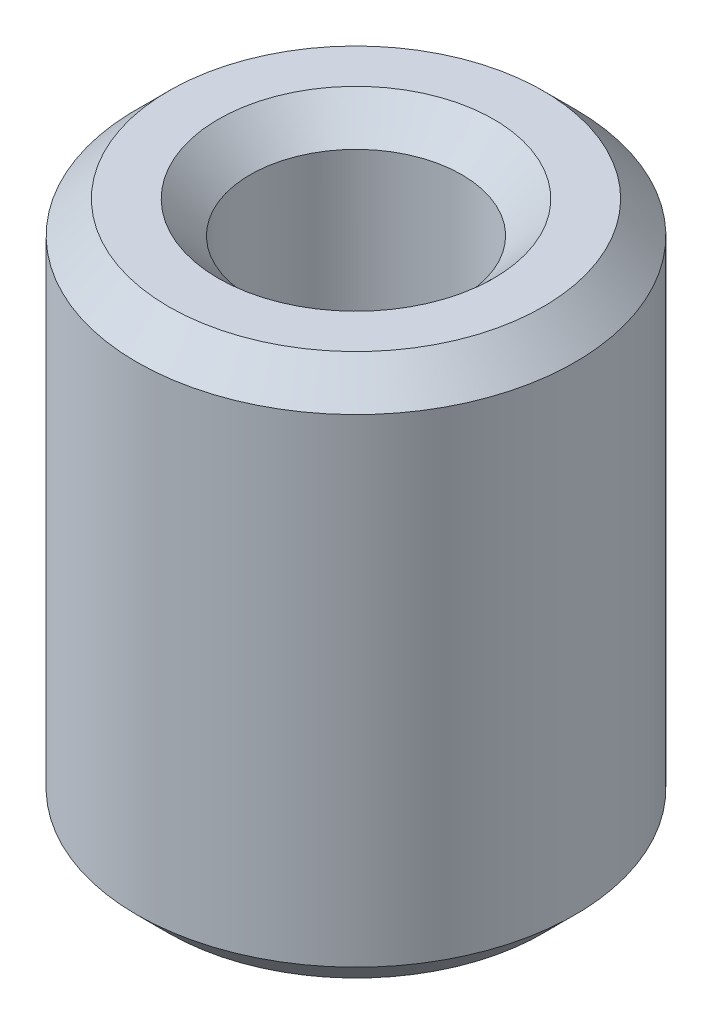
ISO-10303-21;
HEADER;
FILE_DESCRIPTION(('STEP AP214'),'2;1');
FILE_NAME('part.step','',(''),(''),'','','');
FILE_SCHEMA(('AUTOMOTIVE_DESIGN { 1 0 10303 214 1 1 1 1 }'));
ENDSEC;
DATA;
#1=APPLICATION_CONTEXT('core data for automotive mechanical design processes');
#2=APPLICATION_PROTOCOL_DEFINITION('international standard','automotive_design',2000,#1);
#3=PRODUCT_CONTEXT('',#1,'mechanical');
#4=PRODUCT('Part','Part','',(#3));
#5=PRODUCT_RELATED_PRODUCT_CATEGORY('part','',(#4));
#6=PRODUCT_DEFINITION_FORMATION('','',#4);
#7=PRODUCT_DEFINITION_CONTEXT('part definition',#1,'design');
#8=PRODUCT_DEFINITION('design','',#6,#7);
#9=PRODUCT_DEFINITION_SHAPE('','',#8);
#10=(LENGTH_UNIT() NAMED_UNIT(*) SI_UNIT(.MILLI.,.METRE.));
#11=(NAMED_UNIT(*) PLANE_ANGLE_UNIT() SI_UNIT($,.RADIAN.));
#12=(NAMED_UNIT(*) SI_UNIT($,.STERADIAN.) SOLID_ANGLE_UNIT());
#13=UNCERTAINTY_MEASURE_WITH_UNIT(LENGTH_MEASURE(1.E-05),#10,'distance_accuracy_value','');
#14=(GEOMETRIC_REPRESENTATION_CONTEXT(3) GLOBAL_UNCERTAINTY_ASSIGNED_CONTEXT((#13)) GLOBAL_UNIT_ASSIGNED_CONTEXT((#10,
#11,#12)) REPRESENTATION_CONTEXT('',''));
#15=CARTESIAN_POINT('',(0.,0.,0.));
#16=DIRECTION('',(0.,0.,1.));
#17=DIRECTION('',(1.,0.,0.));
#18=AXIS2_PLACEMENT_3D('',#15,#16,#17);
#19=CARTESIAN_POINT('',(0.,12.3808773999114,0.));
#20=DIRECTION('',(0.,-1.,0.));
#21=DIRECTION('',(0.,0.,-1.));
#22=AXIS2_PLACEMENT_3D('',#19,#20,#21);
#23=CYLINDRICAL_SURFACE('',#22,5.);
#24=CARTESIAN_POINT('',(0.,0.729539155545508,0.));
#25=DIRECTION('',(0.,1.,0.));
#26=DIRECTION('',(0.,0.,1.));
#27=AXIS2_PLACEMENT_3D('',#24,#25,#26);
#28=CIRCLE('',#27,5.);
#29=CARTESIAN_POINT('',(0.,0.729539155545508,5.));
#30=VERTEX_POINT('',#29);
#31=EDGE_CURVE('E10',#30,#30,#28,.T.);
#32=ORIENTED_EDGE('',*,*,#31,.T.);
#33=EDGE_LOOP('',(#32));
#34=FACE_BOUND('',#33,.T.);
#35=CARTESIAN_POINT('',(0.,11.6513382443659,0.));
#36=DIRECTION('',(0.,1.,0.));
#37=DIRECTION('',(0.,0.,1.));
#38=AXIS2_PLACEMENT_3D('',#35,#36,#37);
#39=CIRCLE('',#38,5.);
#40=CARTESIAN_POINT('',(0.,11.6513382443659,5.));
#41=VERTEX_POINT('',#40);
#42=EDGE_CURVE('E50',#41,#41,#39,.F.);
#43=ORIENTED_EDGE('',*,*,#42,.T.);
#44=EDGE_LOOP('',(#43));
#45=FACE_BOUND('',#44,.T.);
#46=ADVANCED_FACE('F39',(#34,#45),#23,.T.);
#47=CARTESIAN_POINT('',(0.,12.3808773999114,0.));
#48=DIRECTION('',(0.,1.,0.));
#49=DIRECTION('',(0.,0.,1.));
#50=AXIS2_PLACEMENT_3D('',#47,#48,#49);
#51=PLANE('',#50);
#52=CARTESIAN_POINT('',(0.,12.3808773999114,0.));
#53=DIRECTION('',(0.,1.,0.));
#54=DIRECTION('',(0.,0.,1.));
#55=AXIS2_PLACEMENT_3D('',#52,#53,#54);
#56=CIRCLE('',#55,3.14358391073258);
#57=CARTESIAN_POINT('',(0.,12.3808773999114,3.14358391073258));
#58=VERTEX_POINT('',#57);
#59=EDGE_CURVE('E58',#58,#58,#56,.F.);
#60=ORIENTED_EDGE('',*,*,#59,.T.);
#61=EDGE_LOOP('',(#60));
#62=FACE_BOUND('',#61,.T.);
#63=CARTESIAN_POINT('',(0.,12.3808773999114,0.));
#64=DIRECTION('',(0.,1.,0.));
#65=DIRECTION('',(0.,0.,1.));
#66=AXIS2_PLACEMENT_3D('',#63,#64,#65);
#67=CIRCLE('',#66,4.27046084445449);
#68=CARTESIAN_POINT('',(0.,12.3808773999114,4.27046084445449));
#69=VERTEX_POINT('',#68);
#70=EDGE_CURVE('E61',#69,#69,#67,.T.);
#71=ORIENTED_EDGE('',*,*,#70,.T.);
#72=EDGE_LOOP('',(#71));
#73=FACE_BOUND('',#72,.T.);
#74=ADVANCED_FACE('F88',(#62,#73),#51,.T.);
#75=CARTESIAN_POINT('',(0.,0.,0.));
#76=DIRECTION('',(0.,1.,0.));
#77=DIRECTION('',(0.,0.,1.));
#78=AXIS2_PLACEMENT_3D('',#75,#76,#77);
#79=PLANE('',#78);
#80=CARTESIAN_POINT('',(0.,0.,0.));
#81=DIRECTION('',(0.,1.,0.));
#82=DIRECTION('',(0.,0.,1.));
#83=AXIS2_PLACEMENT_3D('',#80,#81,#82);
#84=CIRCLE('',#83,3.14358391073258);
#85=CARTESIAN_POINT('',(0.,0.,-3.14358391073258));
#86=VERTEX_POINT('',#85);
#87=EDGE_CURVE('E51',#86,#86,#84,.T.);
#88=ORIENTED_EDGE('',*,*,#87,.T.);
#89=EDGE_LOOP('',(#88));
#90=FACE_BOUND('',#89,.T.);
#91=CARTESIAN_POINT('',(0.,0.,0.));
#92=DIRECTION('',(0.,1.,0.));
#93=DIRECTION('',(0.,0.,1.));
#94=AXIS2_PLACEMENT_3D('',#91,#92,#93);
#95=CIRCLE('',#94,4.27046084445449);
#96=CARTESIAN_POINT('',(0.,0.,4.27046084445449));
#97=VERTEX_POINT('',#96);
#98=EDGE_CURVE('E54',#97,#97,#95,.F.);
#99=ORIENTED_EDGE('',*,*,#98,.T.);
#100=EDGE_LOOP('',(#99));
#101=FACE_BOUND('',#100,.T.);
#102=ADVANCED_FACE('F83',(#90,#101),#79,.F.);
#103=CARTESIAN_POINT('',(0.,12.3808773999114,0.));
#104=DIRECTION('',(0.,-1.,0.));
#105=DIRECTION('',(0.,0.,-1.));
#106=AXIS2_PLACEMENT_3D('',#103,#104,#105);
#107=CYLINDRICAL_SURFACE('',#106,2.41404475518707);
#108=CARTESIAN_POINT('',(0.,11.6513382443659,0.));
#109=DIRECTION('',(0.,1.,0.));
#110=DIRECTION('',(0.,0.,1.));
#111=AXIS2_PLACEMENT_3D('',#108,#109,#110);
#112=CIRCLE('',#111,2.41404475518707);
#113=CARTESIAN_POINT('',(0.,11.6513382443659,2.41404475518707));
#114=VERTEX_POINT('',#113);
#115=EDGE_CURVE('E67',#114,#114,#112,.T.);
#116=ORIENTED_EDGE('',*,*,#115,.T.);
#117=EDGE_LOOP('',(#116));
#118=FACE_BOUND('',#117,.T.);
#119=CARTESIAN_POINT('',(0.,0.729539155545515,0.));
#120=DIRECTION('',(0.,1.,0.));
#121=DIRECTION('',(0.,0.,1.));
#122=AXIS2_PLACEMENT_3D('',#119,#120,#121);
#123=CIRCLE('',#122,2.41404475518707);
#124=CARTESIAN_POINT('',(0.,0.729539155545515,-2.41404475518707));
#125=VERTEX_POINT('',#124);
#126=EDGE_CURVE('E69',#125,#125,#123,.F.);
#127=ORIENTED_EDGE('',*,*,#126,.T.);
#128=EDGE_LOOP('',(#127));
#129=FACE_BOUND('',#128,.T.);
#130=ADVANCED_FACE('F71',(#118,#129),#107,.F.);
#131=CARTESIAN_POINT('',(0.,11.6513382443659,0.));
#132=DIRECTION('',(0.,1.,0.));
#133=DIRECTION('',(0.,0.,1.));
#134=AXIS2_PLACEMENT_3D('',#131,#132,#133);
#135=CONICAL_SURFACE('',#134,2.41404475518707,0.785398163397451);
#136=ORIENTED_EDGE('',*,*,#59,.F.);
#137=EDGE_LOOP('',(#136));
#138=FACE_BOUND('',#137,.T.);
#139=ORIENTED_EDGE('',*,*,#115,.F.);
#140=EDGE_LOOP('',(#139));
#141=FACE_BOUND('',#140,.T.);
#142=ADVANCED_FACE('F77',(#138,#141),#135,.F.);
#143=CARTESIAN_POINT('',(0.,0.,0.));
#144=DIRECTION('',(0.,-1.,0.));
#145=DIRECTION('',(0.,0.,-1.));
#146=AXIS2_PLACEMENT_3D('',#143,#144,#145);
#147=CONICAL_SURFACE('',#146,3.14358391073258,0.785398163397444);
#148=CARTESIAN_POINT('',(0.,0.729539155545515,-2.41404475518707));
#149=CARTESIAN_POINT('',(0.,0.721939789341916,-2.42164412139067));
#150=CARTESIAN_POINT('',(0.,0.714340423138317,-2.42924348759427));
#151=CARTESIAN_POINT('',(0.,0.699141690731119,-2.44444222000147));
#152=CARTESIAN_POINT('',(0.,0.69154232452752,-2.45204158620506));
#153=CARTESIAN_POINT('',(0.,0.676343592120321,-2.46724031861226));
#154=CARTESIAN_POINT('',(0.,0.668744225916722,-2.47483968481586));
#155=CARTESIAN_POINT('',(0.,0.653545493509524,-2.49003841722306));
#156=CARTESIAN_POINT('',(0.,0.645946127305925,-2.49763778342666));
#157=CARTESIAN_POINT('',(0.,0.630747394898727,-2.51283651583386));
#158=CARTESIAN_POINT('',(0.,0.623148028695127,-2.52043588203746));
#159=CARTESIAN_POINT('',(0.,0.607949296287929,-2.53563461444465));
#160=CARTESIAN_POINT('',(0.,0.60034993008433,-2.54323398064825));
#161=CARTESIAN_POINT('',(0.,0.585151197677132,-2.55843271305545));
#162=CARTESIAN_POINT('',(0.,0.577551831473533,-2.56603207925905));
#163=CARTESIAN_POINT('',(0.,0.562353099066335,-2.58123081166625));
#164=CARTESIAN_POINT('',(0.,0.554753732862735,-2.58883017786985));
#165=CARTESIAN_POINT('',(0.,0.539555000455537,-2.60402891027705));
#166=CARTESIAN_POINT('',(0.,0.531955634251938,-2.61162827648064));
#167=CARTESIAN_POINT('',(0.,0.51675690184474,-2.62682700888784));
#168=CARTESIAN_POINT('',(0.,0.509157535641141,-2.63442637509144));
#169=CARTESIAN_POINT('',(0.,0.493958803233943,-2.64962510749864));
#170=CARTESIAN_POINT('',(0.,0.486359437030343,-2.65722447370224));
#171=CARTESIAN_POINT('',(0.,0.471160704623145,-2.67242320610944));
#172=CARTESIAN_POINT('',(0.,0.463561338419546,-2.68002257231304));
#173=CARTESIAN_POINT('',(0.,0.448362606012348,-2.69522130472023));
#174=CARTESIAN_POINT('',(0.,0.440763239808749,-2.70282067092383));
#175=CARTESIAN_POINT('',(0.,0.42556450740155,-2.71801940333103));
#176=CARTESIAN_POINT('',(0.,0.417965141197951,-2.72561876953463));
#177=CARTESIAN_POINT('',(0.,0.402766408790753,-2.74081750194183));
#178=CARTESIAN_POINT('',(0.,0.395167042587154,-2.74841686814543));
#179=CARTESIAN_POINT('',(0.,0.379968310179956,-2.76361560055263));
#180=CARTESIAN_POINT('',(0.,0.372368943976357,-2.77121496675622));
#181=CARTESIAN_POINT('',(0.,0.357170211569158,-2.78641369916342));
#182=CARTESIAN_POINT('',(0.,0.349570845365559,-2.79401306536702));
#183=CARTESIAN_POINT('',(0.,0.334372112958361,-2.80921179777422));
#184=CARTESIAN_POINT('',(0.,0.326772746754762,-2.81681116397782));
#185=CARTESIAN_POINT('',(0.,0.311574014347564,-2.83200989638502));
#186=CARTESIAN_POINT('',(0.,0.303974648143965,-2.83960926258862));
#187=CARTESIAN_POINT('',(0.,0.288775915736766,-2.85480799499581));
#188=CARTESIAN_POINT('',(0.,0.281176549533167,-2.86240736119941));
#189=CARTESIAN_POINT('',(0.,0.265977817125969,-2.87760609360661));
#190=CARTESIAN_POINT('',(0.,0.25837845092237,-2.88520545981021));
#191=CARTESIAN_POINT('',(0.,0.243179718515172,-2.90040419221741));
#192=CARTESIAN_POINT('',(0.,0.235580352311573,-2.90800355842101));
#193=CARTESIAN_POINT('',(0.,0.220381619904374,-2.92320229082821));
#194=CARTESIAN_POINT('',(0.,0.212782253700775,-2.9308016570318));
#195=CARTESIAN_POINT('',(0.,0.197583521293577,-2.946000389439));
#196=CARTESIAN_POINT('',(0.,0.189984155089978,-2.9535997556426));
#197=CARTESIAN_POINT('',(0.,0.17478542268278,-2.9687984880498));
#198=CARTESIAN_POINT('',(0.,0.167186056479181,-2.9763978542534));
#199=CARTESIAN_POINT('',(0.,0.151987324071982,-2.9915965866606));
#200=CARTESIAN_POINT('',(0.,0.144387957868383,-2.9991959528642));
#201=CARTESIAN_POINT('',(0.,0.129189225461185,-3.01439468527139));
#202=CARTESIAN_POINT('',(0.,0.121589859257586,-3.02199405147499));
#203=CARTESIAN_POINT('',(0.,0.106391126850388,-3.03719278388219));
#204=CARTESIAN_POINT('',(0.,0.0987917606467885,-3.04479215008579));
#205=CARTESIAN_POINT('',(0.,0.0835930282395903,-3.05999088249299));
#206=CARTESIAN_POINT('',(0.,0.0759936620359912,-3.06759024869659));
#207=CARTESIAN_POINT('',(0.,0.0607949296287929,-3.08278898110379));
#208=CARTESIAN_POINT('',(0.,0.0531955634251938,-3.09038834730738));
#209=CARTESIAN_POINT('',(0.,0.0379968310179956,-3.10558707971458));
#210=CARTESIAN_POINT('',(0.,0.0303974648143965,-3.11318644591818));
#211=CARTESIAN_POINT('',(0.,0.0151987324071982,-3.12838517832538));
#212=CARTESIAN_POINT('',(0.,0.00759936620359911,-3.13598454452898));
#213=CARTESIAN_POINT('',(0.,0.,-3.14358391073258));
#214=B_SPLINE_CURVE_WITH_KNOTS('',3,(#148,#149,#150,#151,#152,#153,#154,#155,#156,#157,#158,
#159,#160,#161,#162,#163,#164,#165,#166,#167,#168,#169,#170,#171,#172,#173,#174,#175,#176,#177,
#178,#179,#180,#181,#182,#183,#184,#185,#186,#187,#188,#189,#190,#191,#192,#193,#194,#195,#196,
#197,#198,#199,#200,#201,#202,#203,#204,#205,#206,#207,#208,#209,#210,#211,#212,#213),
.UNSPECIFIED.,.F.,.F.,(4,2,2,2,2,2,2,2,2,2,2,2,2,2,2,2,2,2,2,2,2,2,2,2,2,2,2,2,2,2,2,2,4),(0.,
0.0322413802517087,0.0644827605034174,0.096724140755126,0.128965521006835,0.161206901258543,
0.193448281510252,0.225689661761961,0.257931042013669,0.290172422265378,0.322413802517087,
0.354655182768795,0.386896563020504,0.419137943272213,0.451379323523921,0.48362070377563,
0.515862084027339,0.548103464279047,0.580344844530756,0.612586224782465,0.644827605034174,
0.677068985285882,0.709310365537591,0.7415517457893,0.773793126041008,0.806034506292717,
0.838275886544426,0.870517266796135,0.902758647047843,0.935000027299552,0.967241407551261,
0.999482787802969,1.03172416805468),.UNSPECIFIED.);
#215=EDGE_CURVE('BSEAM73',#125,#86,#214,.T.);
#216=ORIENTED_EDGE('',*,*,#126,.F.);
#217=ORIENTED_EDGE('',*,*,#87,.F.);
#218=ORIENTED_EDGE('',*,*,#215,.T.);
#219=ORIENTED_EDGE('',*,*,#215,.F.);
#220=EDGE_LOOP('',(#216,#218,#217,#219));
#221=FACE_BOUND('',#220,.T.);
#222=ADVANCED_FACE('F73',(#221),#147,.F.);
#223=CARTESIAN_POINT('',(0.,0.729539155545508,0.));
#224=DIRECTION('',(0.,1.,0.));
#225=DIRECTION('',(0.,0.,1.));
#226=AXIS2_PLACEMENT_3D('',#223,#224,#225);
#227=CONICAL_SURFACE('',#226,5.,0.785398163397452);
#228=ORIENTED_EDGE('',*,*,#98,.F.);
#229=EDGE_LOOP('',(#228));
#230=FACE_BOUND('',#229,.T.);
#231=ORIENTED_EDGE('',*,*,#31,.F.);
#232=EDGE_LOOP('',(#231));
#233=FACE_BOUND('',#232,.T.);
#234=ADVANCED_FACE('F76',(#230,#233),#227,.T.);
#235=CARTESIAN_POINT('',(0.,12.3808773999114,0.));
#236=DIRECTION('',(0.,-1.,0.));
#237=DIRECTION('',(0.,0.,-1.));
#238=AXIS2_PLACEMENT_3D('',#235,#236,#237);
#239=CONICAL_SURFACE('',#238,4.27046084445449,0.785398163397445);
#240=ORIENTED_EDGE('',*,*,#42,.F.);
#241=EDGE_LOOP('',(#240));
#242=FACE_BOUND('',#241,.T.);
#243=ORIENTED_EDGE('',*,*,#70,.F.);
#244=EDGE_LOOP('',(#243));
#245=FACE_BOUND('',#244,.T.);
#246=ADVANCED_FACE('F45',(#242,#245),#239,.T.);
#247=CLOSED_SHELL('',(#46,#74,#102,#130,#142,#222,#234,#246));
#248=MANIFOLD_SOLID_BREP('B2',#247);
#249=ADVANCED_BREP_SHAPE_REPRESENTATION('',(#18,#248),#14);
#250=SHAPE_DEFINITION_REPRESENTATION(#9,#249);
ENDSEC;
END-ISO-10303-21;
